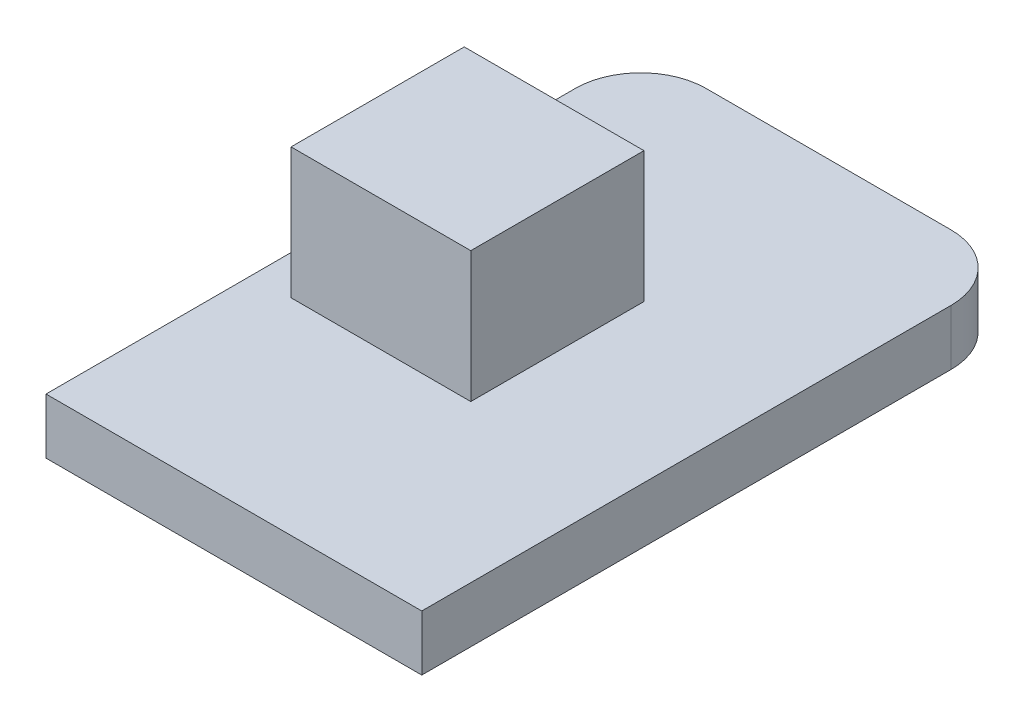
ISO-10303-21;
HEADER;
FILE_DESCRIPTION(('STEP AP214'),'2;1');
FILE_NAME('part.step','',(''),(''),'','','');
FILE_SCHEMA(('AUTOMOTIVE_DESIGN { 1 0 10303 214 1 1 1 1 }'));
ENDSEC;
DATA;
#1=APPLICATION_CONTEXT('core data for automotive mechanical design processes');
#2=APPLICATION_PROTOCOL_DEFINITION('international standard','automotive_design',2000,#1);
#3=PRODUCT_CONTEXT('',#1,'mechanical');
#4=PRODUCT('Part','Part','',(#3));
#5=PRODUCT_RELATED_PRODUCT_CATEGORY('part','',(#4));
#6=PRODUCT_DEFINITION_FORMATION('','',#4);
#7=PRODUCT_DEFINITION_CONTEXT('part definition',#1,'design');
#8=PRODUCT_DEFINITION('design','',#6,#7);
#9=PRODUCT_DEFINITION_SHAPE('','',#8);
#10=(LENGTH_UNIT() NAMED_UNIT(*) SI_UNIT(.MILLI.,.METRE.));
#11=(NAMED_UNIT(*) PLANE_ANGLE_UNIT() SI_UNIT($,.RADIAN.));
#12=(NAMED_UNIT(*) SI_UNIT($,.STERADIAN.) SOLID_ANGLE_UNIT());
#13=UNCERTAINTY_MEASURE_WITH_UNIT(LENGTH_MEASURE(1.E-05),#10,'distance_accuracy_value','');
#14=(GEOMETRIC_REPRESENTATION_CONTEXT(3) GLOBAL_UNCERTAINTY_ASSIGNED_CONTEXT((#13)) GLOBAL_UNIT_ASSIGNED_CONTEXT((#10,
#11,#12)) REPRESENTATION_CONTEXT('',''));
#15=CARTESIAN_POINT('',(0.,0.,0.));
#16=DIRECTION('',(0.,0.,1.));
#17=DIRECTION('',(1.,0.,0.));
#18=AXIS2_PLACEMENT_3D('',#15,#16,#17);
#19=CARTESIAN_POINT('',(5.75,1.7,-7.09999999999999));
#20=DIRECTION('',(-1.,0.,0.));
#21=DIRECTION('',(0.,0.,1.));
#22=AXIS2_PLACEMENT_3D('',#19,#20,#21);
#23=PLANE('',#22);
#24=DIRECTION('',(0.,0.,-1.));
#25=VECTOR('',#24,1.);
#26=CARTESIAN_POINT('',(5.75,0.,-7.09999999999999));
#27=LINE('',#26,#25);
#28=CARTESIAN_POINT('',(5.75,0.,9.1));
#29=VERTEX_POINT('',#28);
#30=CARTESIAN_POINT('',(5.75,0.,-7.09999999999999));
#31=VERTEX_POINT('',#30);
#32=EDGE_CURVE('E139',#29,#31,#27,.T.);
#33=ORIENTED_EDGE('',*,*,#32,.T.);
#34=DIRECTION('',(0.,-1.,0.));
#35=VECTOR('',#34,1.);
#36=CARTESIAN_POINT('',(5.75,1.7,-7.09999999999999));
#37=LINE('',#36,#35);
#38=CARTESIAN_POINT('',(5.75,1.7,-7.09999999999999));
#39=VERTEX_POINT('',#38);
#40=EDGE_CURVE('E11',#39,#31,#37,.T.);
#41=ORIENTED_EDGE('',*,*,#40,.F.);
#42=DIRECTION('',(0.,0.,-1.));
#43=VECTOR('',#42,1.);
#44=CARTESIAN_POINT('',(5.75,1.7,-7.09999999999999));
#45=LINE('',#44,#43);
#46=CARTESIAN_POINT('',(5.75,1.7,9.1));
#47=VERTEX_POINT('',#46);
#48=EDGE_CURVE('E150',#47,#39,#45,.T.);
#49=ORIENTED_EDGE('',*,*,#48,.F.);
#50=DIRECTION('',(0.,-1.,0.));
#51=VECTOR('',#50,1.);
#52=CARTESIAN_POINT('',(5.75,1.7,9.1));
#53=LINE('',#52,#51);
#54=EDGE_CURVE('E169',#47,#29,#53,.T.);
#55=ORIENTED_EDGE('',*,*,#54,.T.);
#56=EDGE_LOOP('',(#33,#41,#49,#55));
#57=FACE_BOUND('',#56,.T.);
#58=ADVANCED_FACE('F39',(#57),#23,.F.);
#59=CARTESIAN_POINT('',(3.75,1.7,-7.1));
#60=DIRECTION('',(0.,-1.,0.));
#61=DIRECTION('',(0.,0.,-1.));
#62=AXIS2_PLACEMENT_3D('',#59,#60,#61);
#63=CYLINDRICAL_SURFACE('',#62,2.);
#64=CARTESIAN_POINT('',(3.75,0.,-7.1));
#65=DIRECTION('',(0.,1.,0.));
#66=DIRECTION('',(0.,0.,-1.));
#67=AXIS2_PLACEMENT_3D('',#64,#65,#66);
#68=CIRCLE('',#67,2.);
#69=CARTESIAN_POINT('',(3.74999999999999,0.,-9.1));
#70=VERTEX_POINT('',#69);
#71=EDGE_CURVE('E144',#31,#70,#68,.T.);
#72=ORIENTED_EDGE('',*,*,#71,.T.);
#73=DIRECTION('',(0.,-1.,0.));
#74=VECTOR('',#73,1.);
#75=CARTESIAN_POINT('',(3.74999999999999,1.7,-9.1));
#76=LINE('',#75,#74);
#77=CARTESIAN_POINT('',(3.74999999999999,1.7,-9.1));
#78=VERTEX_POINT('',#77);
#79=EDGE_CURVE('E47',#78,#70,#76,.T.);
#80=ORIENTED_EDGE('',*,*,#79,.F.);
#81=CARTESIAN_POINT('',(3.75,1.7,-7.1));
#82=DIRECTION('',(0.,1.,0.));
#83=DIRECTION('',(0.,0.,-1.));
#84=AXIS2_PLACEMENT_3D('',#81,#82,#83);
#85=CIRCLE('',#84,2.);
#86=EDGE_CURVE('E154',#39,#78,#85,.T.);
#87=ORIENTED_EDGE('',*,*,#86,.F.);
#88=ORIENTED_EDGE('',*,*,#40,.T.);
#89=EDGE_LOOP('',(#72,#80,#87,#88));
#90=FACE_BOUND('',#89,.T.);
#91=ADVANCED_FACE('F227',(#90),#63,.T.);
#92=CARTESIAN_POINT('',(-3.74999999999998,1.7,-9.1));
#93=DIRECTION('',(0.,0.,1.));
#94=DIRECTION('',(1.,0.,0.));
#95=AXIS2_PLACEMENT_3D('',#92,#93,#94);
#96=PLANE('',#95);
#97=DIRECTION('',(-1.,0.,0.));
#98=VECTOR('',#97,1.);
#99=CARTESIAN_POINT('',(-3.74999999999998,0.,-9.1));
#100=LINE('',#99,#98);
#101=CARTESIAN_POINT('',(-3.74999999999998,0.,-9.1));
#102=VERTEX_POINT('',#101);
#103=EDGE_CURVE('E173',#70,#102,#100,.T.);
#104=ORIENTED_EDGE('',*,*,#103,.T.);
#105=DIRECTION('',(0.,-1.,0.));
#106=VECTOR('',#105,1.);
#107=CARTESIAN_POINT('',(-3.74999999999998,1.7,-9.1));
#108=LINE('',#107,#106);
#109=CARTESIAN_POINT('',(-3.74999999999998,1.7,-9.1));
#110=VERTEX_POINT('',#109);
#111=EDGE_CURVE('E195',#110,#102,#108,.T.);
#112=ORIENTED_EDGE('',*,*,#111,.F.);
#113=DIRECTION('',(-1.,0.,0.));
#114=VECTOR('',#113,1.);
#115=CARTESIAN_POINT('',(-3.74999999999998,1.7,-9.1));
#116=LINE('',#115,#114);
#117=EDGE_CURVE('E158',#78,#110,#116,.T.);
#118=ORIENTED_EDGE('',*,*,#117,.F.);
#119=ORIENTED_EDGE('',*,*,#79,.T.);
#120=EDGE_LOOP('',(#104,#112,#118,#119));
#121=FACE_BOUND('',#120,.T.);
#122=ADVANCED_FACE('F204',(#121),#96,.F.);
#123=CARTESIAN_POINT('',(-3.75,1.7,-7.1));
#124=DIRECTION('',(0.,-1.,0.));
#125=DIRECTION('',(0.,0.,-1.));
#126=AXIS2_PLACEMENT_3D('',#123,#124,#125);
#127=CYLINDRICAL_SURFACE('',#126,2.);
#128=CARTESIAN_POINT('',(-3.75,0.,-7.1));
#129=DIRECTION('',(0.,1.,0.));
#130=DIRECTION('',(0.,0.,1.));
#131=AXIS2_PLACEMENT_3D('',#128,#129,#130);
#132=CIRCLE('',#131,2.);
#133=CARTESIAN_POINT('',(-5.75,0.,-7.09999999999999));
#134=VERTEX_POINT('',#133);
#135=EDGE_CURVE('E176',#102,#134,#132,.T.);
#136=ORIENTED_EDGE('',*,*,#135,.T.);
#137=DIRECTION('',(0.,-1.,0.));
#138=VECTOR('',#137,1.);
#139=CARTESIAN_POINT('',(-5.75,1.7,-7.09999999999999));
#140=LINE('',#139,#138);
#141=CARTESIAN_POINT('',(-5.75,1.7,-7.09999999999999));
#142=VERTEX_POINT('',#141);
#143=EDGE_CURVE('E191',#142,#134,#140,.T.);
#144=ORIENTED_EDGE('',*,*,#143,.F.);
#145=CARTESIAN_POINT('',(-3.75,1.7,-7.1));
#146=DIRECTION('',(0.,1.,0.));
#147=DIRECTION('',(0.,0.,1.));
#148=AXIS2_PLACEMENT_3D('',#145,#146,#147);
#149=CIRCLE('',#148,2.);
#150=EDGE_CURVE('E161',#110,#142,#149,.T.);
#151=ORIENTED_EDGE('',*,*,#150,.F.);
#152=ORIENTED_EDGE('',*,*,#111,.T.);
#153=EDGE_LOOP('',(#136,#144,#151,#152));
#154=FACE_BOUND('',#153,.T.);
#155=ADVANCED_FACE('F215',(#154),#127,.T.);
#156=CARTESIAN_POINT('',(-5.75,1.7,-7.09999999999999));
#157=DIRECTION('',(1.,0.,0.));
#158=DIRECTION('',(0.,0.,-1.));
#159=AXIS2_PLACEMENT_3D('',#156,#157,#158);
#160=PLANE('',#159);
#161=DIRECTION('',(0.,0.,1.));
#162=VECTOR('',#161,1.);
#163=CARTESIAN_POINT('',(-5.75,0.,-7.09999999999999));
#164=LINE('',#163,#162);
#165=CARTESIAN_POINT('',(-5.75,0.,9.1));
#166=VERTEX_POINT('',#165);
#167=EDGE_CURVE('E179',#134,#166,#164,.T.);
#168=ORIENTED_EDGE('',*,*,#167,.T.);
#169=DIRECTION('',(0.,-1.,0.));
#170=VECTOR('',#169,1.);
#171=CARTESIAN_POINT('',(-5.75,1.7,9.1));
#172=LINE('',#171,#170);
#173=CARTESIAN_POINT('',(-5.75,1.7,9.1));
#174=VERTEX_POINT('',#173);
#175=EDGE_CURVE('E187',#174,#166,#172,.T.);
#176=ORIENTED_EDGE('',*,*,#175,.F.);
#177=DIRECTION('',(0.,0.,1.));
#178=VECTOR('',#177,1.);
#179=CARTESIAN_POINT('',(-5.75,1.7,-7.09999999999999));
#180=LINE('',#179,#178);
#181=EDGE_CURVE('E164',#142,#174,#180,.T.);
#182=ORIENTED_EDGE('',*,*,#181,.F.);
#183=ORIENTED_EDGE('',*,*,#143,.T.);
#184=EDGE_LOOP('',(#168,#176,#182,#183));
#185=FACE_BOUND('',#184,.T.);
#186=ADVANCED_FACE('F219',(#185),#160,.F.);
#187=CARTESIAN_POINT('',(-5.75,1.7,9.1));
#188=DIRECTION('',(0.,0.,-1.));
#189=DIRECTION('',(-1.,0.,0.));
#190=AXIS2_PLACEMENT_3D('',#187,#188,#189);
#191=PLANE('',#190);
#192=DIRECTION('',(1.,0.,0.));
#193=VECTOR('',#192,1.);
#194=CARTESIAN_POINT('',(-5.75,0.,9.1));
#195=LINE('',#194,#193);
#196=EDGE_CURVE('E155',#166,#29,#195,.T.);
#197=ORIENTED_EDGE('',*,*,#196,.T.);
#198=ORIENTED_EDGE('',*,*,#54,.F.);
#199=DIRECTION('',(1.,0.,0.));
#200=VECTOR('',#199,1.);
#201=CARTESIAN_POINT('',(-5.75,1.7,9.1));
#202=LINE('',#201,#200);
#203=EDGE_CURVE('E167',#174,#47,#202,.T.);
#204=ORIENTED_EDGE('',*,*,#203,.F.);
#205=ORIENTED_EDGE('',*,*,#175,.T.);
#206=EDGE_LOOP('',(#197,#198,#204,#205));
#207=FACE_BOUND('',#206,.T.);
#208=ADVANCED_FACE('F230',(#207),#191,.F.);
#209=CARTESIAN_POINT('',(-3.75,1.7,-7.1));
#210=DIRECTION('',(0.,1.,0.));
#211=DIRECTION('',(0.,0.,1.));
#212=AXIS2_PLACEMENT_3D('',#209,#210,#211);
#213=PLANE('',#212);
#214=DIRECTION('',(0.,0.,1.));
#215=VECTOR('',#214,1.);
#216=CARTESIAN_POINT('',(-4.55,1.7,-2.5));
#217=LINE('',#216,#215);
#218=CARTESIAN_POINT('',(-4.55,1.7,-2.5));
#219=VERTEX_POINT('',#218);
#220=CARTESIAN_POINT('',(-4.55,1.7,2.8));
#221=VERTEX_POINT('',#220);
#222=EDGE_CURVE('E54',#219,#221,#217,.T.);
#223=ORIENTED_EDGE('',*,*,#222,.F.);
#224=DIRECTION('',(-1.,0.,0.));
#225=VECTOR('',#224,1.);
#226=CARTESIAN_POINT('',(-4.55,1.7,-2.5));
#227=LINE('',#226,#225);
#228=CARTESIAN_POINT('',(0.950000000000002,1.7,-2.5));
#229=VERTEX_POINT('',#228);
#230=EDGE_CURVE('E58',#229,#219,#227,.T.);
#231=ORIENTED_EDGE('',*,*,#230,.F.);
#232=DIRECTION('',(0.,0.,-1.));
#233=VECTOR('',#232,1.);
#234=CARTESIAN_POINT('',(0.950000000000002,1.7,-2.5));
#235=LINE('',#234,#233);
#236=CARTESIAN_POINT('',(0.950000000000003,1.7,2.8));
#237=VERTEX_POINT('',#236);
#238=EDGE_CURVE('E327',#237,#229,#235,.T.);
#239=ORIENTED_EDGE('',*,*,#238,.F.);
#240=DIRECTION('',(1.,0.,0.));
#241=VECTOR('',#240,1.);
#242=CARTESIAN_POINT('',(-4.55,1.7,2.8));
#243=LINE('',#242,#241);
#244=EDGE_CURVE('E337',#221,#237,#243,.T.);
#245=ORIENTED_EDGE('',*,*,#244,.F.);
#246=EDGE_LOOP('',(#223,#231,#239,#245));
#247=FACE_BOUND('',#246,.T.);
#248=ORIENTED_EDGE('',*,*,#48,.T.);
#249=ORIENTED_EDGE('',*,*,#86,.T.);
#250=ORIENTED_EDGE('',*,*,#117,.T.);
#251=ORIENTED_EDGE('',*,*,#150,.T.);
#252=ORIENTED_EDGE('',*,*,#181,.T.);
#253=ORIENTED_EDGE('',*,*,#203,.T.);
#254=EDGE_LOOP('',(#248,#249,#250,#251,#252,#253));
#255=FACE_BOUND('',#254,.T.);
#256=ADVANCED_FACE('F223',(#247,#255),#213,.T.);
#257=CARTESIAN_POINT('',(-3.75,0.,-7.1));
#258=DIRECTION('',(0.,1.,0.));
#259=DIRECTION('',(0.,0.,1.));
#260=AXIS2_PLACEMENT_3D('',#257,#258,#259);
#261=PLANE('',#260);
#262=ORIENTED_EDGE('',*,*,#32,.F.);
#263=ORIENTED_EDGE('',*,*,#196,.F.);
#264=ORIENTED_EDGE('',*,*,#167,.F.);
#265=ORIENTED_EDGE('',*,*,#135,.F.);
#266=ORIENTED_EDGE('',*,*,#103,.F.);
#267=ORIENTED_EDGE('',*,*,#71,.F.);
#268=EDGE_LOOP('',(#262,#263,#264,#265,#266,#267));
#269=FACE_BOUND('',#268,.T.);
#270=ADVANCED_FACE('F210',(#269),#261,.F.);
#271=CARTESIAN_POINT('',(-4.55,5.7,-2.5));
#272=DIRECTION('',(1.,0.,0.));
#273=DIRECTION('',(0.,0.,-1.));
#274=AXIS2_PLACEMENT_3D('',#271,#272,#273);
#275=PLANE('',#274);
#276=ORIENTED_EDGE('',*,*,#222,.T.);
#277=DIRECTION('',(0.,-1.,0.));
#278=VECTOR('',#277,1.);
#279=CARTESIAN_POINT('',(-4.55,5.7,2.8));
#280=LINE('',#279,#278);
#281=CARTESIAN_POINT('',(-4.55,5.7,2.8));
#282=VERTEX_POINT('',#281);
#283=EDGE_CURVE('E119',#282,#221,#280,.T.);
#284=ORIENTED_EDGE('',*,*,#283,.F.);
#285=DIRECTION('',(0.,0.,1.));
#286=VECTOR('',#285,1.);
#287=CARTESIAN_POINT('',(-4.55,5.7,-2.5));
#288=LINE('',#287,#286);
#289=CARTESIAN_POINT('',(-4.55,5.7,-2.5));
#290=VERTEX_POINT('',#289);
#291=EDGE_CURVE('E126',#290,#282,#288,.T.);
#292=ORIENTED_EDGE('',*,*,#291,.F.);
#293=DIRECTION('',(0.,-1.,0.));
#294=VECTOR('',#293,1.);
#295=CARTESIAN_POINT('',(-4.55,5.7,-2.5));
#296=LINE('',#295,#294);
#297=EDGE_CURVE('E324',#290,#219,#296,.T.);
#298=ORIENTED_EDGE('',*,*,#297,.T.);
#299=EDGE_LOOP('',(#276,#284,#292,#298));
#300=FACE_BOUND('',#299,.T.);
#301=ADVANCED_FACE('F137',(#300),#275,.F.);
#302=CARTESIAN_POINT('',(-4.55,5.7,2.8));
#303=DIRECTION('',(0.,0.,-1.));
#304=DIRECTION('',(-1.,0.,0.));
#305=AXIS2_PLACEMENT_3D('',#302,#303,#304);
#306=PLANE('',#305);
#307=ORIENTED_EDGE('',*,*,#244,.T.);
#308=DIRECTION('',(0.,-1.,0.));
#309=VECTOR('',#308,1.);
#310=CARTESIAN_POINT('',(0.950000000000003,5.7,2.8));
#311=LINE('',#310,#309);
#312=CARTESIAN_POINT('',(0.950000000000003,5.7,2.8));
#313=VERTEX_POINT('',#312);
#314=EDGE_CURVE('E121',#313,#237,#311,.T.);
#315=ORIENTED_EDGE('',*,*,#314,.F.);
#316=DIRECTION('',(1.,0.,0.));
#317=VECTOR('',#316,1.);
#318=CARTESIAN_POINT('',(-4.55,5.7,2.8));
#319=LINE('',#318,#317);
#320=EDGE_CURVE('E114',#282,#313,#319,.T.);
#321=ORIENTED_EDGE('',*,*,#320,.F.);
#322=ORIENTED_EDGE('',*,*,#283,.T.);
#323=EDGE_LOOP('',(#307,#315,#321,#322));
#324=FACE_BOUND('',#323,.T.);
#325=ADVANCED_FACE('F117',(#324),#306,.F.);
#326=CARTESIAN_POINT('',(0.950000000000002,5.7,-2.5));
#327=DIRECTION('',(-1.,0.,0.));
#328=DIRECTION('',(0.,0.,1.));
#329=AXIS2_PLACEMENT_3D('',#326,#327,#328);
#330=PLANE('',#329);
#331=ORIENTED_EDGE('',*,*,#238,.T.);
#332=DIRECTION('',(0.,-1.,0.));
#333=VECTOR('',#332,1.);
#334=CARTESIAN_POINT('',(0.950000000000002,5.7,-2.5));
#335=LINE('',#334,#333);
#336=CARTESIAN_POINT('',(0.950000000000002,5.7,-2.5));
#337=VERTEX_POINT('',#336);
#338=EDGE_CURVE('E146',#337,#229,#335,.T.);
#339=ORIENTED_EDGE('',*,*,#338,.F.);
#340=DIRECTION('',(0.,0.,-1.));
#341=VECTOR('',#340,1.);
#342=CARTESIAN_POINT('',(0.950000000000002,5.7,-2.5));
#343=LINE('',#342,#341);
#344=EDGE_CURVE('E125',#313,#337,#343,.T.);
#345=ORIENTED_EDGE('',*,*,#344,.F.);
#346=ORIENTED_EDGE('',*,*,#314,.T.);
#347=EDGE_LOOP('',(#331,#339,#345,#346));
#348=FACE_BOUND('',#347,.T.);
#349=ADVANCED_FACE('F292',(#348),#330,.F.);
#350=CARTESIAN_POINT('',(-4.55,5.7,-2.5));
#351=DIRECTION('',(0.,0.,1.));
#352=DIRECTION('',(1.,0.,0.));
#353=AXIS2_PLACEMENT_3D('',#350,#351,#352);
#354=PLANE('',#353);
#355=ORIENTED_EDGE('',*,*,#230,.T.);
#356=ORIENTED_EDGE('',*,*,#297,.F.);
#357=DIRECTION('',(-1.,0.,0.));
#358=VECTOR('',#357,1.);
#359=CARTESIAN_POINT('',(-4.55,5.7,-2.5));
#360=LINE('',#359,#358);
#361=EDGE_CURVE('E131',#337,#290,#360,.T.);
#362=ORIENTED_EDGE('',*,*,#361,.F.);
#363=ORIENTED_EDGE('',*,*,#338,.T.);
#364=EDGE_LOOP('',(#355,#356,#362,#363));
#365=FACE_BOUND('',#364,.T.);
#366=ADVANCED_FACE('F301',(#365),#354,.F.);
#367=CARTESIAN_POINT('',(0.,5.7,0.));
#368=DIRECTION('',(0.,1.,0.));
#369=DIRECTION('',(0.,0.,1.));
#370=AXIS2_PLACEMENT_3D('',#367,#368,#369);
#371=PLANE('',#370);
#372=ORIENTED_EDGE('',*,*,#291,.T.);
#373=ORIENTED_EDGE('',*,*,#320,.T.);
#374=ORIENTED_EDGE('',*,*,#344,.T.);
#375=ORIENTED_EDGE('',*,*,#361,.T.);
#376=EDGE_LOOP('',(#372,#373,#374,#375));
#377=FACE_BOUND('',#376,.T.);
#378=ADVANCED_FACE('F129',(#377),#371,.T.);
#379=CLOSED_SHELL('',(#58,#91,#122,#155,#186,#208,#256,#270,#301,#325,#349,#366,#378));
#380=MANIFOLD_SOLID_BREP('B2',#379);
#381=ADVANCED_BREP_SHAPE_REPRESENTATION('',(#18,#380),#14);
#382=SHAPE_DEFINITION_REPRESENTATION(#9,#381);
ENDSEC;
END-ISO-10303-21;
